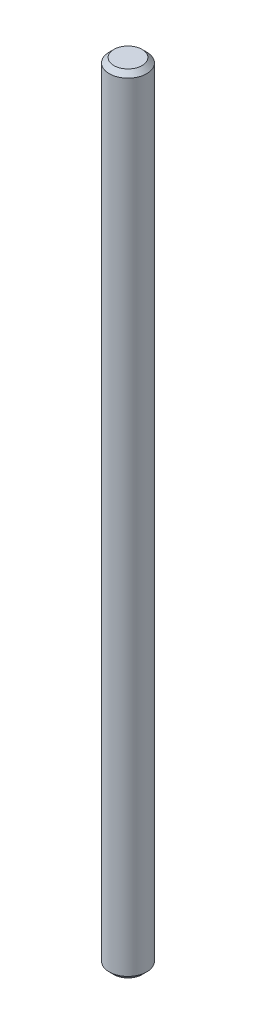
ISO-10303-21;
HEADER;
FILE_DESCRIPTION(('STEP AP214'),'2;1');
FILE_NAME('part.step','',(''),(''),'','','');
FILE_SCHEMA(('AUTOMOTIVE_DESIGN { 1 0 10303 214 1 1 1 1 }'));
ENDSEC;
DATA;
#1=APPLICATION_CONTEXT('core data for automotive mechanical design processes');
#2=APPLICATION_PROTOCOL_DEFINITION('international standard','automotive_design',2000,#1);
#3=PRODUCT_CONTEXT('',#1,'mechanical');
#4=PRODUCT('Part','Part','',(#3));
#5=PRODUCT_RELATED_PRODUCT_CATEGORY('part','',(#4));
#6=PRODUCT_DEFINITION_FORMATION('','',#4);
#7=PRODUCT_DEFINITION_CONTEXT('part definition',#1,'design');
#8=PRODUCT_DEFINITION('design','',#6,#7);
#9=PRODUCT_DEFINITION_SHAPE('','',#8);
#10=(LENGTH_UNIT() NAMED_UNIT(*) SI_UNIT(.MILLI.,.METRE.));
#11=(NAMED_UNIT(*) PLANE_ANGLE_UNIT() SI_UNIT($,.RADIAN.));
#12=(NAMED_UNIT(*) SI_UNIT($,.STERADIAN.) SOLID_ANGLE_UNIT());
#13=UNCERTAINTY_MEASURE_WITH_UNIT(LENGTH_MEASURE(1.E-05),#10,'distance_accuracy_value','');
#14=(GEOMETRIC_REPRESENTATION_CONTEXT(3) GLOBAL_UNCERTAINTY_ASSIGNED_CONTEXT((#13)) GLOBAL_UNIT_ASSIGNED_CONTEXT((#10,
#11,#12)) REPRESENTATION_CONTEXT('',''));
#15=CARTESIAN_POINT('',(0.,0.,0.));
#16=DIRECTION('',(0.,0.,1.));
#17=DIRECTION('',(1.,0.,0.));
#18=AXIS2_PLACEMENT_3D('',#15,#16,#17);
#19=CARTESIAN_POINT('',(0.,84.,0.));
#20=DIRECTION('',(0.,-1.,0.));
#21=DIRECTION('',(0.,0.,-1.));
#22=AXIS2_PLACEMENT_3D('',#19,#20,#21);
#23=CYLINDRICAL_SURFACE('',#22,2.);
#24=CARTESIAN_POINT('',(0.,0.500000000000042,0.));
#25=DIRECTION('',(0.,1.,0.));
#26=DIRECTION('',(0.,0.,1.));
#27=AXIS2_PLACEMENT_3D('',#24,#25,#26);
#28=CIRCLE('',#27,2.);
#29=CARTESIAN_POINT('',(0.,0.500000000000042,2.));
#30=VERTEX_POINT('',#29);
#31=EDGE_CURVE('E45',#30,#30,#28,.T.);
#32=ORIENTED_EDGE('',*,*,#31,.T.);
#33=EDGE_LOOP('',(#32));
#34=FACE_BOUND('',#33,.T.);
#35=CARTESIAN_POINT('',(0.,83.5,0.));
#36=DIRECTION('',(0.,1.,0.));
#37=DIRECTION('',(0.,0.,1.));
#38=AXIS2_PLACEMENT_3D('',#35,#36,#37);
#39=CIRCLE('',#38,2.);
#40=CARTESIAN_POINT('',(0.,83.5,2.));
#41=VERTEX_POINT('',#40);
#42=EDGE_CURVE('E49',#41,#41,#39,.F.);
#43=ORIENTED_EDGE('',*,*,#42,.T.);
#44=EDGE_LOOP('',(#43));
#45=FACE_BOUND('',#44,.T.);
#46=ADVANCED_FACE('F33',(#34,#45),#23,.T.);
#47=CARTESIAN_POINT('',(0.,84.,0.));
#48=DIRECTION('',(0.,1.,0.));
#49=DIRECTION('',(0.,0.,1.));
#50=AXIS2_PLACEMENT_3D('',#47,#48,#49);
#51=PLANE('',#50);
#52=CARTESIAN_POINT('',(0.,84.,0.));
#53=DIRECTION('',(0.,1.,0.));
#54=DIRECTION('',(0.,0.,1.));
#55=AXIS2_PLACEMENT_3D('',#52,#53,#54);
#56=CIRCLE('',#55,1.50000000000003);
#57=CARTESIAN_POINT('',(0.,84.,1.50000000000003));
#58=VERTEX_POINT('',#57);
#59=EDGE_CURVE('E10',#58,#58,#56,.T.);
#60=ORIENTED_EDGE('',*,*,#59,.T.);
#61=EDGE_LOOP('',(#60));
#62=FACE_BOUND('',#61,.T.);
#63=ADVANCED_FACE('F65',(#62),#51,.T.);
#64=CARTESIAN_POINT('',(0.,0.,0.));
#65=DIRECTION('',(0.,1.,0.));
#66=DIRECTION('',(0.,0.,1.));
#67=AXIS2_PLACEMENT_3D('',#64,#65,#66);
#68=PLANE('',#67);
#69=CARTESIAN_POINT('',(0.,0.,0.));
#70=DIRECTION('',(0.,1.,0.));
#71=DIRECTION('',(0.,0.,1.));
#72=AXIS2_PLACEMENT_3D('',#69,#70,#71);
#73=CIRCLE('',#72,1.49999999999995);
#74=CARTESIAN_POINT('',(0.,0.,1.49999999999995));
#75=VERTEX_POINT('',#74);
#76=EDGE_CURVE('E41',#75,#75,#73,.F.);
#77=ORIENTED_EDGE('',*,*,#76,.T.);
#78=EDGE_LOOP('',(#77));
#79=FACE_BOUND('',#78,.T.);
#80=ADVANCED_FACE('F62',(#79),#68,.F.);
#81=CARTESIAN_POINT('',(0.,0.500000000000042,0.));
#82=DIRECTION('',(0.,1.,0.));
#83=DIRECTION('',(0.,0.,1.));
#84=AXIS2_PLACEMENT_3D('',#81,#82,#83);
#85=CONICAL_SURFACE('',#84,2.,0.785398163397454);
#86=ORIENTED_EDGE('',*,*,#76,.F.);
#87=EDGE_LOOP('',(#86));
#88=FACE_BOUND('',#87,.T.);
#89=ORIENTED_EDGE('',*,*,#31,.F.);
#90=EDGE_LOOP('',(#89));
#91=FACE_BOUND('',#90,.T.);
#92=ADVANCED_FACE('F58',(#88,#91),#85,.T.);
#93=CARTESIAN_POINT('',(0.,84.,0.));
#94=DIRECTION('',(0.,-1.,0.));
#95=DIRECTION('',(0.,0.,-1.));
#96=AXIS2_PLACEMENT_3D('',#93,#94,#95);
#97=CONICAL_SURFACE('',#96,1.50000000000003,0.785398163397461);
#98=ORIENTED_EDGE('',*,*,#42,.F.);
#99=EDGE_LOOP('',(#98));
#100=FACE_BOUND('',#99,.T.);
#101=ORIENTED_EDGE('',*,*,#59,.F.);
#102=EDGE_LOOP('',(#101));
#103=FACE_BOUND('',#102,.T.);
#104=ADVANCED_FACE('F36',(#100,#103),#97,.T.);
#105=CLOSED_SHELL('',(#46,#63,#80,#92,#104));
#106=MANIFOLD_SOLID_BREP('B2',#105);
#107=ADVANCED_BREP_SHAPE_REPRESENTATION('',(#18,#106),#14);
#108=SHAPE_DEFINITION_REPRESENTATION(#9,#107);
ENDSEC;
END-ISO-10303-21;
